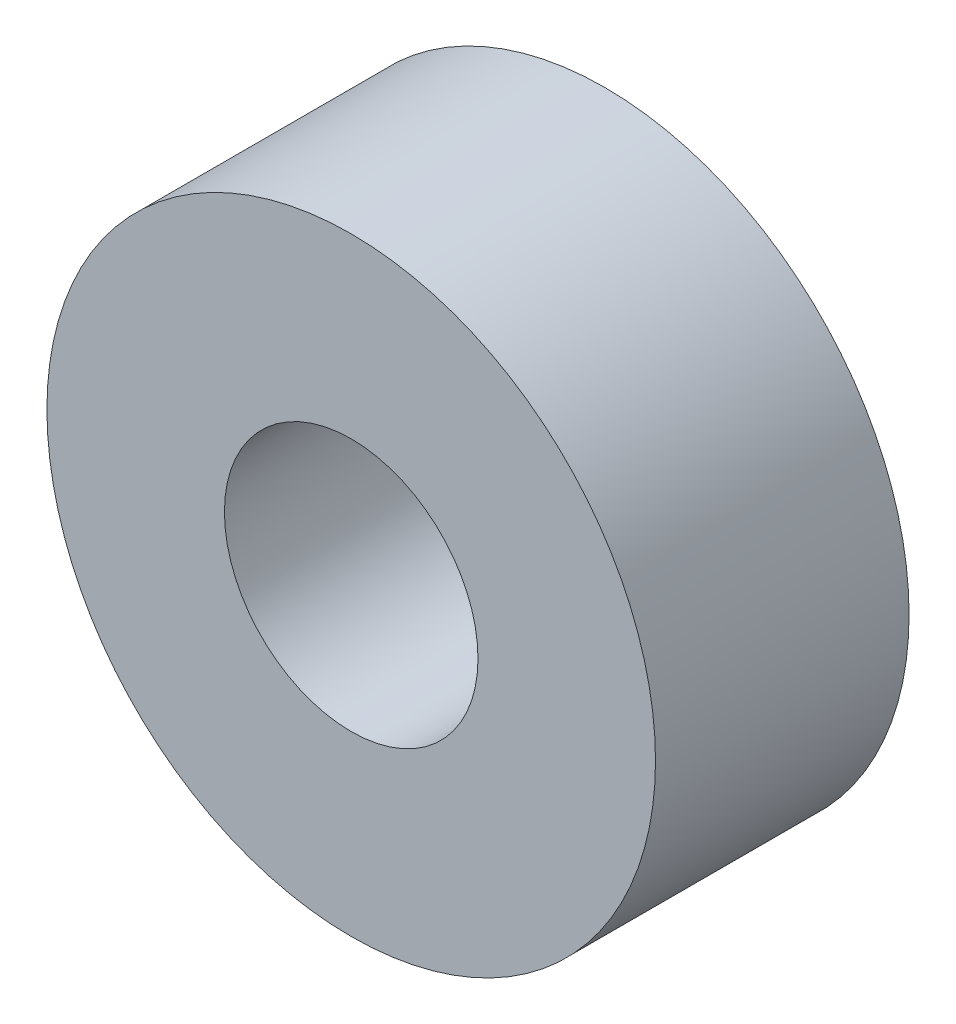
ISO-10303-21;
HEADER;
FILE_DESCRIPTION(('STEP AP214'),'2;1');
FILE_NAME('part.step','',(''),(''),'','','');
FILE_SCHEMA(('AUTOMOTIVE_DESIGN { 1 0 10303 214 1 1 1 1 }'));
ENDSEC;
DATA;
#1=APPLICATION_CONTEXT('core data for automotive mechanical design processes');
#2=APPLICATION_PROTOCOL_DEFINITION('international standard','automotive_design',2000,#1);
#3=PRODUCT_CONTEXT('',#1,'mechanical');
#4=PRODUCT('Part','Part','',(#3));
#5=PRODUCT_RELATED_PRODUCT_CATEGORY('part','',(#4));
#6=PRODUCT_DEFINITION_FORMATION('','',#4);
#7=PRODUCT_DEFINITION_CONTEXT('part definition',#1,'design');
#8=PRODUCT_DEFINITION('design','',#6,#7);
#9=PRODUCT_DEFINITION_SHAPE('','',#8);
#10=(LENGTH_UNIT() NAMED_UNIT(*) SI_UNIT(.MILLI.,.METRE.));
#11=(NAMED_UNIT(*) PLANE_ANGLE_UNIT() SI_UNIT($,.RADIAN.));
#12=(NAMED_UNIT(*) SI_UNIT($,.STERADIAN.) SOLID_ANGLE_UNIT());
#13=UNCERTAINTY_MEASURE_WITH_UNIT(LENGTH_MEASURE(1.E-05),#10,'distance_accuracy_value','');
#14=(GEOMETRIC_REPRESENTATION_CONTEXT(3) GLOBAL_UNCERTAINTY_ASSIGNED_CONTEXT((#13)) GLOBAL_UNIT_ASSIGNED_CONTEXT((#10,
#11,#12)) REPRESENTATION_CONTEXT('',''));
#15=CARTESIAN_POINT('',(0.,0.,0.));
#16=DIRECTION('',(0.,0.,1.));
#17=DIRECTION('',(1.,0.,0.));
#18=AXIS2_PLACEMENT_3D('',#15,#16,#17);
#19=CARTESIAN_POINT('',(0.,0.,5.));
#20=DIRECTION('',(0.,0.,1.));
#21=DIRECTION('',(1.,0.,0.));
#22=AXIS2_PLACEMENT_3D('',#19,#20,#21);
#23=PLANE('',#22);
#24=CARTESIAN_POINT('',(0.,0.,5.));
#25=DIRECTION('',(0.,0.,1.));
#26=DIRECTION('',(1.,0.,0.));
#27=AXIS2_PLACEMENT_3D('',#24,#25,#26);
#28=CIRCLE('',#27,12.);
#29=CARTESIAN_POINT('',(12.,0.,5.));
#30=VERTEX_POINT('',#29);
#31=EDGE_CURVE('E10',#30,#30,#28,.T.);
#32=ORIENTED_EDGE('',*,*,#31,.T.);
#33=EDGE_LOOP('',(#32));
#34=FACE_BOUND('',#33,.T.);
#35=CARTESIAN_POINT('',(0.,0.,5.));
#36=DIRECTION('',(0.,0.,1.));
#37=DIRECTION('',(1.,0.,0.));
#38=AXIS2_PLACEMENT_3D('',#35,#36,#37);
#39=CIRCLE('',#38,5.);
#40=CARTESIAN_POINT('',(5.,0.,5.));
#41=VERTEX_POINT('',#40);
#42=EDGE_CURVE('E43',#41,#41,#39,.T.);
#43=ORIENTED_EDGE('',*,*,#42,.F.);
#44=EDGE_LOOP('',(#43));
#45=FACE_BOUND('',#44,.T.);
#46=ADVANCED_FACE('F32',(#34,#45),#23,.T.);
#47=CARTESIAN_POINT('',(0.,0.,-5.));
#48=DIRECTION('',(0.,0.,1.));
#49=DIRECTION('',(1.,0.,0.));
#50=AXIS2_PLACEMENT_3D('',#47,#48,#49);
#51=PLANE('',#50);
#52=CARTESIAN_POINT('',(0.,0.,-5.));
#53=DIRECTION('',(0.,0.,1.));
#54=DIRECTION('',(1.,0.,0.));
#55=AXIS2_PLACEMENT_3D('',#52,#53,#54);
#56=CIRCLE('',#55,12.);
#57=CARTESIAN_POINT('',(12.,0.,-5.));
#58=VERTEX_POINT('',#57);
#59=EDGE_CURVE('E36',#58,#58,#56,.T.);
#60=ORIENTED_EDGE('',*,*,#59,.F.);
#61=EDGE_LOOP('',(#60));
#62=FACE_BOUND('',#61,.T.);
#63=CARTESIAN_POINT('',(0.,0.,-5.));
#64=DIRECTION('',(0.,0.,1.));
#65=DIRECTION('',(1.,0.,0.));
#66=AXIS2_PLACEMENT_3D('',#63,#64,#65);
#67=CIRCLE('',#66,5.);
#68=CARTESIAN_POINT('',(5.,0.,-5.));
#69=VERTEX_POINT('',#68);
#70=EDGE_CURVE('E45',#69,#69,#67,.T.);
#71=ORIENTED_EDGE('',*,*,#70,.T.);
#72=EDGE_LOOP('',(#71));
#73=FACE_BOUND('',#72,.T.);
#74=ADVANCED_FACE('F55',(#62,#73),#51,.F.);
#75=CARTESIAN_POINT('',(0.,0.,5.));
#76=DIRECTION('',(0.,0.,-1.));
#77=DIRECTION('',(-1.,0.,0.));
#78=AXIS2_PLACEMENT_3D('',#75,#76,#77);
#79=CYLINDRICAL_SURFACE('',#78,12.);
#80=ORIENTED_EDGE('',*,*,#31,.F.);
#81=EDGE_LOOP('',(#80));
#82=FACE_BOUND('',#81,.T.);
#83=ORIENTED_EDGE('',*,*,#59,.T.);
#84=EDGE_LOOP('',(#83));
#85=FACE_BOUND('',#84,.T.);
#86=ADVANCED_FACE('F34',(#82,#85),#79,.T.);
#87=CARTESIAN_POINT('',(0.,0.,5.));
#88=DIRECTION('',(0.,0.,-1.));
#89=DIRECTION('',(-1.,0.,0.));
#90=AXIS2_PLACEMENT_3D('',#87,#88,#89);
#91=CYLINDRICAL_SURFACE('',#90,5.);
#92=ORIENTED_EDGE('',*,*,#42,.T.);
#93=EDGE_LOOP('',(#92));
#94=FACE_BOUND('',#93,.T.);
#95=ORIENTED_EDGE('',*,*,#70,.F.);
#96=EDGE_LOOP('',(#95));
#97=FACE_BOUND('',#96,.T.);
#98=ADVANCED_FACE('F51',(#94,#97),#91,.F.);
#99=CLOSED_SHELL('',(#46,#74,#86,#98));
#100=MANIFOLD_SOLID_BREP('B2',#99);
#101=ADVANCED_BREP_SHAPE_REPRESENTATION('',(#18,#100),#14);
#102=SHAPE_DEFINITION_REPRESENTATION(#9,#101);
ENDSEC;
END-ISO-10303-21;
